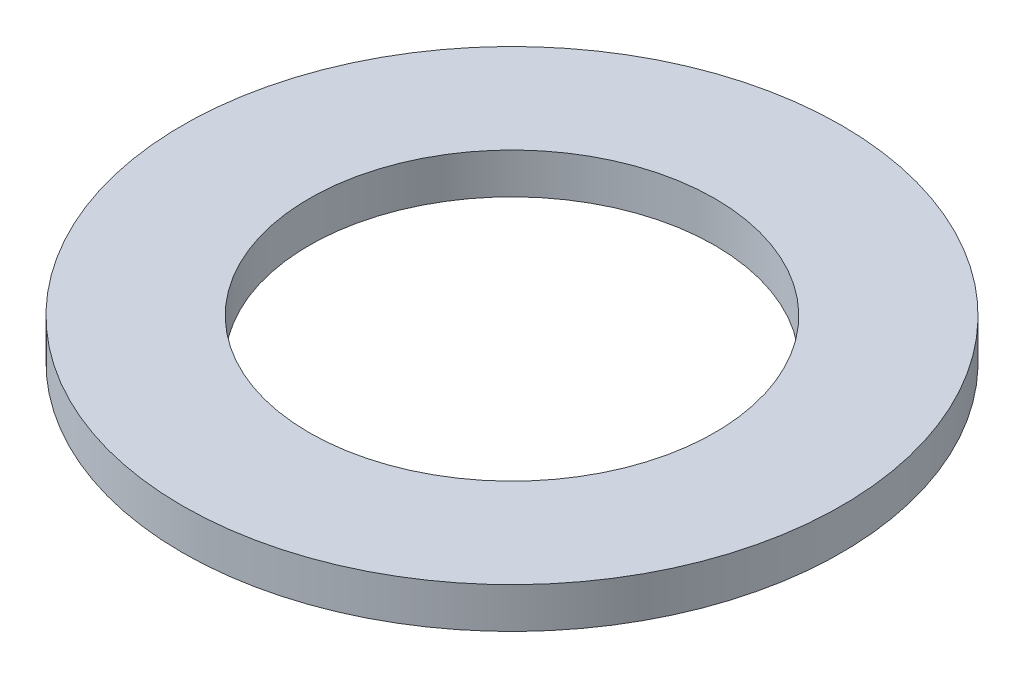
ISO-10303-21;
HEADER;
FILE_DESCRIPTION(('STEP AP214'),'2;1');
FILE_NAME('part.step','',(''),(''),'','','');
FILE_SCHEMA(('AUTOMOTIVE_DESIGN { 1 0 10303 214 1 1 1 1 }'));
ENDSEC;
DATA;
#1=APPLICATION_CONTEXT('core data for automotive mechanical design processes');
#2=APPLICATION_PROTOCOL_DEFINITION('international standard','automotive_design',2000,#1);
#3=PRODUCT_CONTEXT('',#1,'mechanical');
#4=PRODUCT('Part','Part','',(#3));
#5=PRODUCT_RELATED_PRODUCT_CATEGORY('part','',(#4));
#6=PRODUCT_DEFINITION_FORMATION('','',#4);
#7=PRODUCT_DEFINITION_CONTEXT('part definition',#1,'design');
#8=PRODUCT_DEFINITION('design','',#6,#7);
#9=PRODUCT_DEFINITION_SHAPE('','',#8);
#10=(LENGTH_UNIT() NAMED_UNIT(*) SI_UNIT(.MILLI.,.METRE.));
#11=(NAMED_UNIT(*) PLANE_ANGLE_UNIT() SI_UNIT($,.RADIAN.));
#12=(NAMED_UNIT(*) SI_UNIT($,.STERADIAN.) SOLID_ANGLE_UNIT());
#13=UNCERTAINTY_MEASURE_WITH_UNIT(LENGTH_MEASURE(1.E-05),#10,'distance_accuracy_value','');
#14=(GEOMETRIC_REPRESENTATION_CONTEXT(3) GLOBAL_UNCERTAINTY_ASSIGNED_CONTEXT((#13)) GLOBAL_UNIT_ASSIGNED_CONTEXT((#10,
#11,#12)) REPRESENTATION_CONTEXT('',''));
#15=CARTESIAN_POINT('',(0.,0.,0.));
#16=DIRECTION('',(0.,0.,1.));
#17=DIRECTION('',(1.,0.,0.));
#18=AXIS2_PLACEMENT_3D('',#15,#16,#17);
#19=CARTESIAN_POINT('',(0.,4.,0.));
#20=DIRECTION('',(0.,-1.,0.));
#21=DIRECTION('',(0.,0.,-1.));
#22=AXIS2_PLACEMENT_3D('',#19,#20,#21);
#23=CYLINDRICAL_SURFACE('',#22,32.5);
#24=CARTESIAN_POINT('',(0.,4.,0.));
#25=DIRECTION('',(0.,1.,0.));
#26=DIRECTION('',(0.,0.,1.));
#27=AXIS2_PLACEMENT_3D('',#24,#25,#26);
#28=CIRCLE('',#27,32.5);
#29=CARTESIAN_POINT('',(0.,4.,32.5));
#30=VERTEX_POINT('',#29);
#31=EDGE_CURVE('E10',#30,#30,#28,.T.);
#32=ORIENTED_EDGE('',*,*,#31,.F.);
#33=EDGE_LOOP('',(#32));
#34=FACE_BOUND('',#33,.T.);
#35=CARTESIAN_POINT('',(0.,0.,0.));
#36=DIRECTION('',(0.,1.,0.));
#37=DIRECTION('',(0.,0.,1.));
#38=AXIS2_PLACEMENT_3D('',#35,#36,#37);
#39=CIRCLE('',#38,32.5);
#40=CARTESIAN_POINT('',(0.,0.,32.5));
#41=VERTEX_POINT('',#40);
#42=EDGE_CURVE('E37',#41,#41,#39,.T.);
#43=ORIENTED_EDGE('',*,*,#42,.T.);
#44=EDGE_LOOP('',(#43));
#45=FACE_BOUND('',#44,.T.);
#46=ADVANCED_FACE('F40',(#34,#45),#23,.T.);
#47=CARTESIAN_POINT('',(0.,4.,0.));
#48=DIRECTION('',(0.,1.,0.));
#49=DIRECTION('',(0.,0.,1.));
#50=AXIS2_PLACEMENT_3D('',#47,#48,#49);
#51=PLANE('',#50);
#52=CARTESIAN_POINT('',(0.,4.,0.));
#53=DIRECTION('',(0.,1.,0.));
#54=DIRECTION('',(0.,0.,1.));
#55=AXIS2_PLACEMENT_3D('',#52,#53,#54);
#56=CIRCLE('',#55,20.);
#57=CARTESIAN_POINT('',(0.,4.,20.));
#58=VERTEX_POINT('',#57);
#59=EDGE_CURVE('E50',#58,#58,#56,.T.);
#60=ORIENTED_EDGE('',*,*,#59,.F.);
#61=EDGE_LOOP('',(#60));
#62=FACE_BOUND('',#61,.T.);
#63=ORIENTED_EDGE('',*,*,#31,.T.);
#64=EDGE_LOOP('',(#63));
#65=FACE_BOUND('',#64,.T.);
#66=ADVANCED_FACE('F59',(#62,#65),#51,.T.);
#67=CARTESIAN_POINT('',(0.,0.,0.));
#68=DIRECTION('',(0.,1.,0.));
#69=DIRECTION('',(0.,0.,1.));
#70=AXIS2_PLACEMENT_3D('',#67,#68,#69);
#71=PLANE('',#70);
#72=CARTESIAN_POINT('',(0.,0.,0.));
#73=DIRECTION('',(0.,1.,0.));
#74=DIRECTION('',(0.,0.,1.));
#75=AXIS2_PLACEMENT_3D('',#72,#73,#74);
#76=CIRCLE('',#75,20.);
#77=CARTESIAN_POINT('',(0.,0.,20.));
#78=VERTEX_POINT('',#77);
#79=EDGE_CURVE('E47',#78,#78,#76,.T.);
#80=ORIENTED_EDGE('',*,*,#79,.T.);
#81=EDGE_LOOP('',(#80));
#82=FACE_BOUND('',#81,.T.);
#83=ORIENTED_EDGE('',*,*,#42,.F.);
#84=EDGE_LOOP('',(#83));
#85=FACE_BOUND('',#84,.T.);
#86=ADVANCED_FACE('F58',(#82,#85),#71,.F.);
#87=CARTESIAN_POINT('',(0.,4.,0.));
#88=DIRECTION('',(0.,-1.,0.));
#89=DIRECTION('',(0.,0.,-1.));
#90=AXIS2_PLACEMENT_3D('',#87,#88,#89);
#91=CYLINDRICAL_SURFACE('',#90,20.);
#92=ORIENTED_EDGE('',*,*,#59,.T.);
#93=EDGE_LOOP('',(#92));
#94=FACE_BOUND('',#93,.T.);
#95=ORIENTED_EDGE('',*,*,#79,.F.);
#96=EDGE_LOOP('',(#95));
#97=FACE_BOUND('',#96,.T.);
#98=ADVANCED_FACE('F54',(#94,#97),#91,.F.);
#99=CLOSED_SHELL('',(#46,#66,#86,#98));
#100=MANIFOLD_SOLID_BREP('B2',#99);
#101=ADVANCED_BREP_SHAPE_REPRESENTATION('',(#18,#100),#14);
#102=SHAPE_DEFINITION_REPRESENTATION(#9,#101);
ENDSEC;
END-ISO-10303-21;
